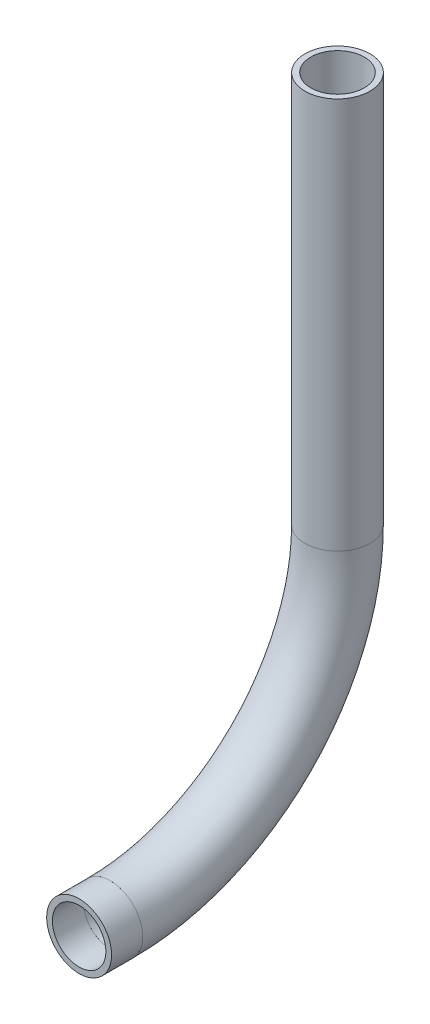
ISO-10303-21;
HEADER;
FILE_DESCRIPTION(('STEP AP214'),'2;1');
FILE_NAME('part.step','',(''),(''),'','','');
FILE_SCHEMA(('AUTOMOTIVE_DESIGN { 1 0 10303 214 1 1 1 1 }'));
ENDSEC;
DATA;
#1=APPLICATION_CONTEXT('core data for automotive mechanical design processes');
#2=APPLICATION_PROTOCOL_DEFINITION('international standard','automotive_design',2000,#1);
#3=PRODUCT_CONTEXT('',#1,'mechanical');
#4=PRODUCT('Part','Part','',(#3));
#5=PRODUCT_RELATED_PRODUCT_CATEGORY('part','',(#4));
#6=PRODUCT_DEFINITION_FORMATION('','',#4);
#7=PRODUCT_DEFINITION_CONTEXT('part definition',#1,'design');
#8=PRODUCT_DEFINITION('design','',#6,#7);
#9=PRODUCT_DEFINITION_SHAPE('','',#8);
#10=(LENGTH_UNIT() NAMED_UNIT(*) SI_UNIT(.MILLI.,.METRE.));
#11=(NAMED_UNIT(*) PLANE_ANGLE_UNIT() SI_UNIT($,.RADIAN.));
#12=(NAMED_UNIT(*) SI_UNIT($,.STERADIAN.) SOLID_ANGLE_UNIT());
#13=UNCERTAINTY_MEASURE_WITH_UNIT(LENGTH_MEASURE(1.E-05),#10,'distance_accuracy_value','');
#14=(GEOMETRIC_REPRESENTATION_CONTEXT(3) GLOBAL_UNCERTAINTY_ASSIGNED_CONTEXT((#13)) GLOBAL_UNIT_ASSIGNED_CONTEXT((#10,
#11,#12)) REPRESENTATION_CONTEXT('',''));
#15=CARTESIAN_POINT('',(0.,0.,0.));
#16=DIRECTION('',(0.,0.,1.));
#17=DIRECTION('',(1.,0.,0.));
#18=AXIS2_PLACEMENT_3D('',#15,#16,#17);
#19=CARTESIAN_POINT('',(0.,600.03453506682,300.09231024861));
#20=DIRECTION('',(0.,0.,1.));
#21=DIRECTION('',(1.,0.,0.));
#22=AXIS2_PLACEMENT_3D('',#19,#20,#21);
#23=CYLINDRICAL_SURFACE('',#22,2.61620000000002);
#24=CARTESIAN_POINT('',(0.,600.03453506682,303.14462575866));
#25=DIRECTION('',(0.,0.,-1.));
#26=DIRECTION('',(-1.,0.,0.));
#27=AXIS2_PLACEMENT_3D('',#24,#25,#26);
#28=CIRCLE('',#27,2.61620000000002);
#29=CARTESIAN_POINT('',(-2.61620000000002,600.03453506682,303.14462575866));
#30=VERTEX_POINT('',#29);
#31=EDGE_CURVE('E55',#30,#30,#28,.T.);
#32=ORIENTED_EDGE('',*,*,#31,.F.);
#33=EDGE_LOOP('',(#32));
#34=FACE_BOUND('',#33,.T.);
#35=CARTESIAN_POINT('',(0.,600.03453506682,300.09231024861));
#36=DIRECTION('',(0.,0.,-1.));
#37=DIRECTION('',(-1.,0.,0.));
#38=AXIS2_PLACEMENT_3D('',#35,#36,#37);
#39=CIRCLE('',#38,2.61620000000002);
#40=CARTESIAN_POINT('',(-2.61620000000002,600.03453506682,300.09231024861));
#41=VERTEX_POINT('',#40);
#42=EDGE_CURVE('E51',#41,#41,#39,.T.);
#43=ORIENTED_EDGE('',*,*,#42,.T.);
#44=EDGE_LOOP('',(#43));
#45=FACE_BOUND('',#44,.T.);
#46=ADVANCED_FACE('F47',(#34,#45),#23,.F.);
#47=CARTESIAN_POINT('',(0.,600.03453506682,300.09231024861));
#48=DIRECTION('',(0.,0.,1.));
#49=DIRECTION('',(1.,0.,0.));
#50=AXIS2_PLACEMENT_3D('',#47,#48,#49);
#51=CYLINDRICAL_SURFACE('',#50,3.17499999999997);
#52=CARTESIAN_POINT('',(0.,600.03453506682,303.14462575866));
#53=DIRECTION('',(0.,0.,-1.));
#54=DIRECTION('',(-1.,0.,0.));
#55=AXIS2_PLACEMENT_3D('',#52,#53,#54);
#56=CIRCLE('',#55,3.17499999999997);
#57=CARTESIAN_POINT('',(-3.17499999999997,600.03453506682,303.14462575866));
#58=VERTEX_POINT('',#57);
#59=EDGE_CURVE('E59',#58,#58,#56,.T.);
#60=ORIENTED_EDGE('',*,*,#59,.T.);
#61=EDGE_LOOP('',(#60));
#62=FACE_BOUND('',#61,.T.);
#63=CARTESIAN_POINT('',(0.,600.03453506682,300.09231024861));
#64=DIRECTION('',(0.,0.,-1.));
#65=DIRECTION('',(-1.,0.,0.));
#66=AXIS2_PLACEMENT_3D('',#63,#64,#65);
#67=CIRCLE('',#66,3.17499999999997);
#68=CARTESIAN_POINT('',(-3.17499999999997,600.03453506682,300.09231024861));
#69=VERTEX_POINT('',#68);
#70=EDGE_CURVE('E12',#69,#69,#67,.T.);
#71=ORIENTED_EDGE('',*,*,#70,.F.);
#72=EDGE_LOOP('',(#71));
#73=FACE_BOUND('',#72,.T.);
#74=ADVANCED_FACE('F74',(#62,#73),#51,.T.);
#75=CARTESIAN_POINT('',(0.,600.03453506682,303.14462575866));
#76=DIRECTION('',(0.,0.,-1.));
#77=DIRECTION('',(-1.,0.,0.));
#78=AXIS2_PLACEMENT_3D('',#75,#76,#77);
#79=PLANE('',#78);
#80=ORIENTED_EDGE('',*,*,#31,.T.);
#81=EDGE_LOOP('',(#80));
#82=FACE_BOUND('',#81,.T.);
#83=ORIENTED_EDGE('',*,*,#59,.F.);
#84=EDGE_LOOP('',(#83));
#85=FACE_BOUND('',#84,.T.);
#86=ADVANCED_FACE('F70',(#82,#85),#79,.F.);
#87=CARTESIAN_POINT('',(0.,600.03453506682,300.09231024861));
#88=DIRECTION('',(0.,0.,-1.));
#89=DIRECTION('',(-1.,0.,0.));
#90=AXIS2_PLACEMENT_3D('',#87,#88,#89);
#91=PLANE('',#90);
#92=ORIENTED_EDGE('',*,*,#42,.F.);
#93=EDGE_LOOP('',(#92));
#94=FACE_BOUND('',#93,.T.);
#95=ORIENTED_EDGE('',*,*,#70,.T.);
#96=EDGE_LOOP('',(#95));
#97=FACE_BOUND('',#96,.T.);
#98=ADVANCED_FACE('F49',(#94,#97),#91,.T.);
#99=CLOSED_SHELL('',(#46,#74,#86,#98));
#100=MANIFOLD_SOLID_BREP('B2',#99);
#101=CARTESIAN_POINT('',(0.,622.25953506682,300.09231024861));
#102=DIRECTION('',(-1.,0.,0.));
#103=DIRECTION('',(0.,0.,1.));
#104=AXIS2_PLACEMENT_3D('',#101,#102,#103);
#105=TOROIDAL_SURFACE('',#104,22.2250000000001,2.61620000000002);
#106=CARTESIAN_POINT('',(0.,622.25953506682,277.867310248609));
#107=DIRECTION('',(0.,1.,0.));
#108=DIRECTION('',(0.,0.,1.));
#109=AXIS2_PLACEMENT_3D('',#106,#107,#108);
#110=CIRCLE('',#109,2.61620000000002);
#111=CARTESIAN_POINT('',(0.,622.25953506682,275.251110248609));
#112=VERTEX_POINT('',#111);
#113=EDGE_CURVE('E150',#112,#112,#110,.T.);
#114=CARTESIAN_POINT('',(0.,600.03453506682,300.09231024861));
#115=DIRECTION('',(0.,0.,1.));
#116=DIRECTION('',(1.,0.,0.));
#117=AXIS2_PLACEMENT_3D('',#114,#115,#116);
#118=CIRCLE('',#117,2.61620000000002);
#119=CARTESIAN_POINT('',(0.,597.41833506682,300.09231024861));
#120=VERTEX_POINT('',#119);
#121=EDGE_CURVE('E140',#120,#120,#118,.T.);
#122=CARTESIAN_POINT('',(0.,622.25953506682,300.09231024861));
#123=DIRECTION('',(-1.,0.,0.));
#124=DIRECTION('',(0.,0.,1.));
#125=AXIS2_PLACEMENT_3D('',#122,#123,#124);
#126=CIRCLE('',#125,24.8412000000001);
#127=EDGE_CURVE('',#112,#120,#126,.T.);
#128=ORIENTED_EDGE('',*,*,#113,.T.);
#129=ORIENTED_EDGE('',*,*,#121,.T.);
#130=ORIENTED_EDGE('',*,*,#127,.T.);
#131=ORIENTED_EDGE('',*,*,#127,.F.);
#132=EDGE_LOOP('',(#128,#130,#129,#131));
#133=FACE_BOUND('',#132,.T.);
#134=ADVANCED_FACE('F136',(#133),#105,.F.);
#135=CARTESIAN_POINT('',(0.,622.25953506682,300.09231024861));
#136=DIRECTION('',(-1.,0.,0.));
#137=DIRECTION('',(0.,0.,1.));
#138=AXIS2_PLACEMENT_3D('',#135,#136,#137);
#139=TOROIDAL_SURFACE('',#138,22.2250000000001,3.17499999999997);
#140=CARTESIAN_POINT('',(0.,622.25953506682,277.867310248609));
#141=DIRECTION('',(0.,1.,0.));
#142=DIRECTION('',(0.,0.,1.));
#143=AXIS2_PLACEMENT_3D('',#140,#141,#142);
#144=CIRCLE('',#143,3.17499999999997);
#145=CARTESIAN_POINT('',(0.,622.25953506682,274.692310248609));
#146=VERTEX_POINT('',#145);
#147=EDGE_CURVE('E144',#146,#146,#144,.T.);
#148=CARTESIAN_POINT('',(0.,600.03453506682,300.09231024861));
#149=DIRECTION('',(0.,0.,1.));
#150=DIRECTION('',(1.,0.,0.));
#151=AXIS2_PLACEMENT_3D('',#148,#149,#150);
#152=CIRCLE('',#151,3.17499999999997);
#153=CARTESIAN_POINT('',(0.,596.85953506682,300.09231024861));
#154=VERTEX_POINT('',#153);
#155=EDGE_CURVE('E46',#154,#154,#152,.T.);
#156=CARTESIAN_POINT('',(0.,622.25953506682,300.09231024861));
#157=DIRECTION('',(-1.,0.,0.));
#158=DIRECTION('',(0.,0.,1.));
#159=AXIS2_PLACEMENT_3D('',#156,#157,#158);
#160=CIRCLE('',#159,25.4000000000001);
#161=EDGE_CURVE('',#146,#154,#160,.T.);
#162=ORIENTED_EDGE('',*,*,#147,.F.);
#163=ORIENTED_EDGE('',*,*,#155,.F.);
#164=ORIENTED_EDGE('',*,*,#161,.T.);
#165=ORIENTED_EDGE('',*,*,#161,.F.);
#166=EDGE_LOOP('',(#162,#164,#163,#165));
#167=FACE_BOUND('',#166,.T.);
#168=ADVANCED_FACE('F163',(#167),#139,.T.);
#169=CARTESIAN_POINT('',(0.,622.25953506682,277.86731024861));
#170=DIRECTION('',(0.,1.,0.));
#171=DIRECTION('',(0.,0.,1.));
#172=AXIS2_PLACEMENT_3D('',#169,#170,#171);
#173=PLANE('',#172);
#174=ORIENTED_EDGE('',*,*,#113,.F.);
#175=EDGE_LOOP('',(#174));
#176=FACE_BOUND('',#175,.T.);
#177=ORIENTED_EDGE('',*,*,#147,.T.);
#178=EDGE_LOOP('',(#177));
#179=FACE_BOUND('',#178,.T.);
#180=ADVANCED_FACE('F159',(#176,#179),#173,.T.);
#181=CARTESIAN_POINT('',(0.,600.03453506682,300.09231024861));
#182=DIRECTION('',(0.,0.,1.));
#183=DIRECTION('',(1.,0.,0.));
#184=AXIS2_PLACEMENT_3D('',#181,#182,#183);
#185=PLANE('',#184);
#186=ORIENTED_EDGE('',*,*,#121,.F.);
#187=EDGE_LOOP('',(#186));
#188=FACE_BOUND('',#187,.T.);
#189=ORIENTED_EDGE('',*,*,#155,.T.);
#190=EDGE_LOOP('',(#189));
#191=FACE_BOUND('',#190,.T.);
#192=ADVANCED_FACE('F138',(#188,#191),#185,.T.);
#193=CLOSED_SHELL('',(#134,#168,#180,#192));
#194=MANIFOLD_SOLID_BREP('B7',#193);
#195=CARTESIAN_POINT('',(0.,660.572281208422,277.86731024861));
#196=DIRECTION('',(0.,-1.,0.));
#197=DIRECTION('',(0.,0.,-1.));
#198=AXIS2_PLACEMENT_3D('',#195,#196,#197);
#199=CYLINDRICAL_SURFACE('',#198,2.61620000000002);
#200=CARTESIAN_POINT('',(0.,660.572281208422,277.86731024861));
#201=DIRECTION('',(0.,1.,0.));
#202=DIRECTION('',(-1.,0.,0.));
#203=AXIS2_PLACEMENT_3D('',#200,#201,#202);
#204=CIRCLE('',#203,2.61620000000002);
#205=CARTESIAN_POINT('',(-2.61620000000002,660.572281208422,277.86731024861));
#206=VERTEX_POINT('',#205);
#207=EDGE_CURVE('E234',#206,#206,#204,.T.);
#208=ORIENTED_EDGE('',*,*,#207,.T.);
#209=EDGE_LOOP('',(#208));
#210=FACE_BOUND('',#209,.T.);
#211=CARTESIAN_POINT('',(0.,622.25953506682,277.86731024861));
#212=DIRECTION('',(0.,-1.,0.));
#213=DIRECTION('',(0.,0.,-1.));
#214=AXIS2_PLACEMENT_3D('',#211,#212,#213);
#215=CIRCLE('',#214,2.61620000000002);
#216=CARTESIAN_POINT('',(0.,622.25953506682,275.25111024861));
#217=VERTEX_POINT('',#216);
#218=EDGE_CURVE('E224',#217,#217,#215,.T.);
#219=ORIENTED_EDGE('',*,*,#218,.T.);
#220=EDGE_LOOP('',(#219));
#221=FACE_BOUND('',#220,.T.);
#222=ADVANCED_FACE('F220',(#210,#221),#199,.F.);
#223=CARTESIAN_POINT('',(0.,660.572281208422,277.86731024861));
#224=DIRECTION('',(0.,-1.,0.));
#225=DIRECTION('',(0.,0.,-1.));
#226=AXIS2_PLACEMENT_3D('',#223,#224,#225);
#227=CYLINDRICAL_SURFACE('',#226,3.17499999999997);
#228=CARTESIAN_POINT('',(0.,660.572281208422,277.86731024861));
#229=DIRECTION('',(0.,1.,0.));
#230=DIRECTION('',(-1.,0.,0.));
#231=AXIS2_PLACEMENT_3D('',#228,#229,#230);
#232=CIRCLE('',#231,3.17499999999997);
#233=CARTESIAN_POINT('',(-3.17499999999997,660.572281208422,277.86731024861));
#234=VERTEX_POINT('',#233);
#235=EDGE_CURVE('E228',#234,#234,#232,.T.);
#236=ORIENTED_EDGE('',*,*,#235,.F.);
#237=EDGE_LOOP('',(#236));
#238=FACE_BOUND('',#237,.T.);
#239=CARTESIAN_POINT('',(0.,622.25953506682,277.86731024861));
#240=DIRECTION('',(0.,-1.,0.));
#241=DIRECTION('',(0.,0.,-1.));
#242=AXIS2_PLACEMENT_3D('',#239,#240,#241);
#243=CIRCLE('',#242,3.17499999999997);
#244=CARTESIAN_POINT('',(0.,622.25953506682,274.69231024861));
#245=VERTEX_POINT('',#244);
#246=EDGE_CURVE('E135',#245,#245,#243,.T.);
#247=ORIENTED_EDGE('',*,*,#246,.F.);
#248=EDGE_LOOP('',(#247));
#249=FACE_BOUND('',#248,.T.);
#250=ADVANCED_FACE('F247',(#238,#249),#227,.T.);
#251=CARTESIAN_POINT('',(0.,660.572281208422,277.86731024861));
#252=DIRECTION('',(0.,1.,0.));
#253=DIRECTION('',(-1.,0.,0.));
#254=AXIS2_PLACEMENT_3D('',#251,#252,#253);
#255=PLANE('',#254);
#256=ORIENTED_EDGE('',*,*,#207,.F.);
#257=EDGE_LOOP('',(#256));
#258=FACE_BOUND('',#257,.T.);
#259=ORIENTED_EDGE('',*,*,#235,.T.);
#260=EDGE_LOOP('',(#259));
#261=FACE_BOUND('',#260,.T.);
#262=ADVANCED_FACE('F243',(#258,#261),#255,.T.);
#263=CARTESIAN_POINT('',(0.,622.25953506682,277.86731024861));
#264=DIRECTION('',(0.,-1.,0.));
#265=DIRECTION('',(0.,0.,-1.));
#266=AXIS2_PLACEMENT_3D('',#263,#264,#265);
#267=PLANE('',#266);
#268=ORIENTED_EDGE('',*,*,#218,.F.);
#269=EDGE_LOOP('',(#268));
#270=FACE_BOUND('',#269,.T.);
#271=ORIENTED_EDGE('',*,*,#246,.T.);
#272=EDGE_LOOP('',(#271));
#273=FACE_BOUND('',#272,.T.);
#274=ADVANCED_FACE('F222',(#270,#273),#267,.T.);
#275=CLOSED_SHELL('',(#222,#250,#262,#274));
#276=MANIFOLD_SOLID_BREP('B41',#275);
#277=ADVANCED_BREP_SHAPE_REPRESENTATION('',(#18,#100,#194,#276),#14);
#278=SHAPE_DEFINITION_REPRESENTATION(#9,#277);
ENDSEC;
END-ISO-10303-21;
